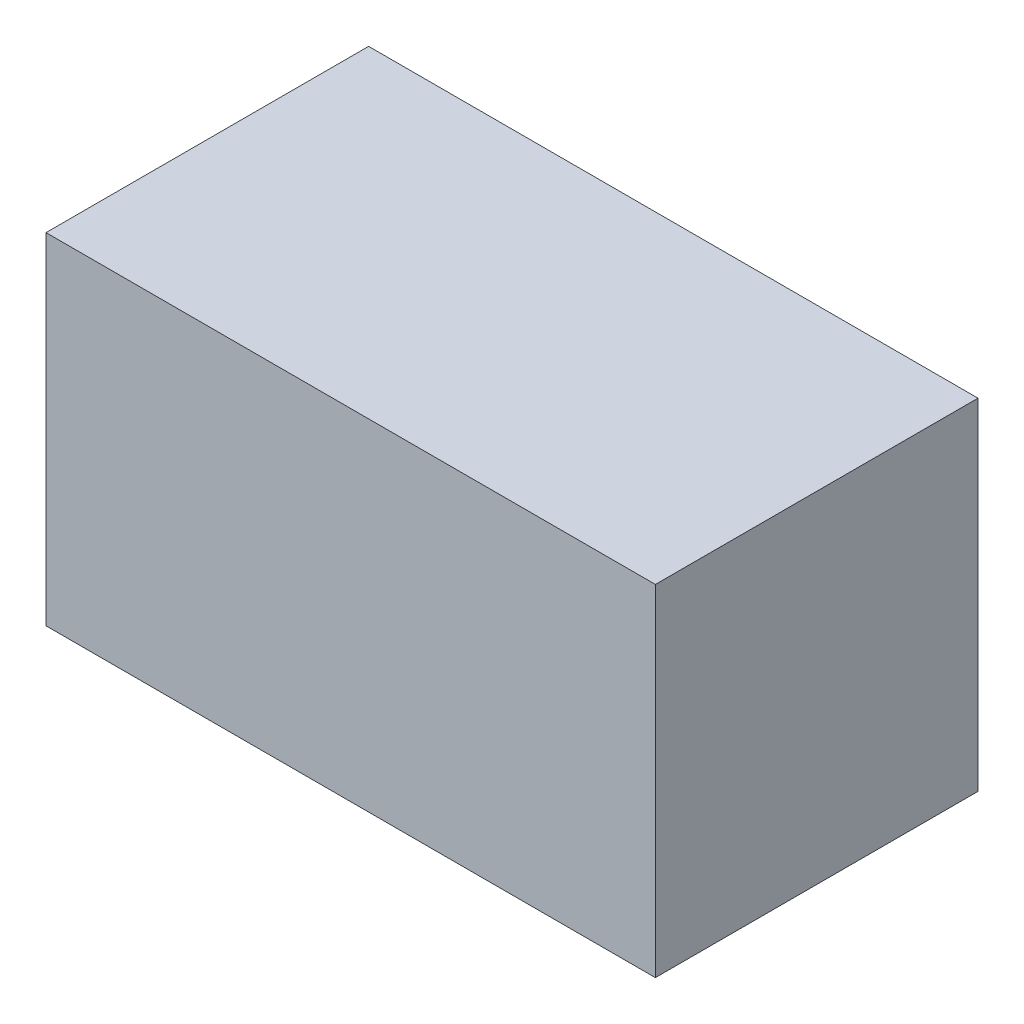
ISO-10303-21;
HEADER;
FILE_DESCRIPTION(('STEP AP214'),'2;1');
FILE_NAME('part.step','',(''),(''),'','','');
FILE_SCHEMA(('AUTOMOTIVE_DESIGN { 1 0 10303 214 1 1 1 1 }'));
ENDSEC;
DATA;
#1=APPLICATION_CONTEXT('core data for automotive mechanical design processes');
#2=APPLICATION_PROTOCOL_DEFINITION('international standard','automotive_design',2000,#1);
#3=PRODUCT_CONTEXT('',#1,'mechanical');
#4=PRODUCT('Part','Part','',(#3));
#5=PRODUCT_RELATED_PRODUCT_CATEGORY('part','',(#4));
#6=PRODUCT_DEFINITION_FORMATION('','',#4);
#7=PRODUCT_DEFINITION_CONTEXT('part definition',#1,'design');
#8=PRODUCT_DEFINITION('design','',#6,#7);
#9=PRODUCT_DEFINITION_SHAPE('','',#8);
#10=(LENGTH_UNIT() NAMED_UNIT(*) SI_UNIT(.MILLI.,.METRE.));
#11=(NAMED_UNIT(*) PLANE_ANGLE_UNIT() SI_UNIT($,.RADIAN.));
#12=(NAMED_UNIT(*) SI_UNIT($,.STERADIAN.) SOLID_ANGLE_UNIT());
#13=UNCERTAINTY_MEASURE_WITH_UNIT(LENGTH_MEASURE(1.E-05),#10,'distance_accuracy_value','');
#14=(GEOMETRIC_REPRESENTATION_CONTEXT(3) GLOBAL_UNCERTAINTY_ASSIGNED_CONTEXT((#13)) GLOBAL_UNIT_ASSIGNED_CONTEXT((#10,
#11,#12)) REPRESENTATION_CONTEXT('',''));
#15=CARTESIAN_POINT('',(0.,0.,0.));
#16=DIRECTION('',(0.,0.,1.));
#17=DIRECTION('',(1.,0.,0.));
#18=AXIS2_PLACEMENT_3D('',#15,#16,#17);
#19=CARTESIAN_POINT('',(0.85000084,0.47500032,0.90000074));
#20=DIRECTION('',(0.,0.,-1.));
#21=DIRECTION('',(-1.,0.,0.));
#22=AXIS2_PLACEMENT_3D('',#19,#20,#21);
#23=PLANE('',#22);
#24=DIRECTION('',(0.,1.,0.));
#25=VECTOR('',#24,1.);
#26=CARTESIAN_POINT('',(-0.85000084,0.47500032,0.90000074));
#27=LINE('',#26,#25);
#28=CARTESIAN_POINT('',(-0.85000084,0.47500032,0.90000074));
#29=VERTEX_POINT('',#28);
#30=CARTESIAN_POINT('',(-0.85000084,-0.47500032,0.90000074));
#31=VERTEX_POINT('',#30);
#32=EDGE_CURVE('E55',#29,#31,#27,.F.);
#33=ORIENTED_EDGE('',*,*,#32,.T.);
#34=DIRECTION('',(1.,0.,0.));
#35=VECTOR('',#34,1.);
#36=CARTESIAN_POINT('',(-0.85000084,-0.47500032,0.90000074));
#37=LINE('',#36,#35);
#38=CARTESIAN_POINT('',(0.85000084,-0.47500032,0.90000074));
#39=VERTEX_POINT('',#38);
#40=EDGE_CURVE('E57',#31,#39,#37,.T.);
#41=ORIENTED_EDGE('',*,*,#40,.T.);
#42=DIRECTION('',(0.,1.,0.));
#43=VECTOR('',#42,1.);
#44=CARTESIAN_POINT('',(0.85000084,-0.47500032,0.90000074));
#45=LINE('',#44,#43);
#46=CARTESIAN_POINT('',(0.85000084,0.47500032,0.90000074));
#47=VERTEX_POINT('',#46);
#48=EDGE_CURVE('E20',#39,#47,#45,.T.);
#49=ORIENTED_EDGE('',*,*,#48,.T.);
#50=DIRECTION('',(1.,0.,0.));
#51=VECTOR('',#50,1.);
#52=CARTESIAN_POINT('',(0.85000084,0.47500032,0.90000074));
#53=LINE('',#52,#51);
#54=EDGE_CURVE('E80',#47,#29,#53,.F.);
#55=ORIENTED_EDGE('',*,*,#54,.T.);
#56=EDGE_LOOP('',(#33,#41,#49,#55));
#57=FACE_BOUND('',#56,.T.);
#58=ADVANCED_FACE('F17',(#57),#23,.F.);
#59=CARTESIAN_POINT('',(0.85000084,-0.47500032,0.));
#60=DIRECTION('',(-1.,0.,0.));
#61=DIRECTION('',(0.,0.,1.));
#62=AXIS2_PLACEMENT_3D('',#59,#60,#61);
#63=PLANE('',#62);
#64=DIRECTION('',(0.,0.,-1.));
#65=VECTOR('',#64,1.);
#66=CARTESIAN_POINT('',(0.85000084,0.47500032,0.));
#67=LINE('',#66,#65);
#68=CARTESIAN_POINT('',(0.85000084,0.47500032,0.));
#69=VERTEX_POINT('',#68);
#70=EDGE_CURVE('E68',#69,#47,#67,.F.);
#71=ORIENTED_EDGE('',*,*,#70,.T.);
#72=ORIENTED_EDGE('',*,*,#48,.F.);
#73=DIRECTION('',(0.,0.,1.));
#74=VECTOR('',#73,1.);
#75=CARTESIAN_POINT('',(0.85000084,-0.47500032,0.));
#76=LINE('',#75,#74);
#77=CARTESIAN_POINT('',(0.85000084,-0.47500032,0.));
#78=VERTEX_POINT('',#77);
#79=EDGE_CURVE('E63',#39,#78,#76,.F.);
#80=ORIENTED_EDGE('',*,*,#79,.T.);
#81=DIRECTION('',(0.,1.,0.));
#82=VECTOR('',#81,1.);
#83=CARTESIAN_POINT('',(0.85000084,0.47500032,0.));
#84=LINE('',#83,#82);
#85=EDGE_CURVE('E83',#69,#78,#84,.F.);
#86=ORIENTED_EDGE('',*,*,#85,.F.);
#87=EDGE_LOOP('',(#71,#72,#80,#86));
#88=FACE_BOUND('',#87,.T.);
#89=ADVANCED_FACE('F65',(#88),#63,.F.);
#90=CARTESIAN_POINT('',(-0.85000084,-0.47500032,0.));
#91=DIRECTION('',(0.,1.,0.));
#92=DIRECTION('',(0.,0.,1.));
#93=AXIS2_PLACEMENT_3D('',#90,#91,#92);
#94=PLANE('',#93);
#95=ORIENTED_EDGE('',*,*,#79,.F.);
#96=ORIENTED_EDGE('',*,*,#40,.F.);
#97=DIRECTION('',(0.,0.,-1.));
#98=VECTOR('',#97,1.);
#99=CARTESIAN_POINT('',(-0.85000084,-0.47500032,0.));
#100=LINE('',#99,#98);
#101=CARTESIAN_POINT('',(-0.85000084,-0.47500032,0.));
#102=VERTEX_POINT('',#101);
#103=EDGE_CURVE('E75',#31,#102,#100,.T.);
#104=ORIENTED_EDGE('',*,*,#103,.T.);
#105=DIRECTION('',(-1.,0.,0.));
#106=VECTOR('',#105,1.);
#107=CARTESIAN_POINT('',(0.85000084,-0.47500032,0.));
#108=LINE('',#107,#106);
#109=EDGE_CURVE('E72',#78,#102,#108,.T.);
#110=ORIENTED_EDGE('',*,*,#109,.F.);
#111=EDGE_LOOP('',(#95,#96,#104,#110));
#112=FACE_BOUND('',#111,.T.);
#113=ADVANCED_FACE('F70',(#112),#94,.F.);
#114=CARTESIAN_POINT('',(-0.85000084,0.47500032,0.));
#115=DIRECTION('',(1.,0.,0.));
#116=DIRECTION('',(0.,0.,-1.));
#117=AXIS2_PLACEMENT_3D('',#114,#115,#116);
#118=PLANE('',#117);
#119=ORIENTED_EDGE('',*,*,#103,.F.);
#120=ORIENTED_EDGE('',*,*,#32,.F.);
#121=DIRECTION('',(0.,0.,-1.));
#122=VECTOR('',#121,1.);
#123=CARTESIAN_POINT('',(-0.85000084,0.47500032,0.));
#124=LINE('',#123,#122);
#125=CARTESIAN_POINT('',(-0.85000084,0.47500032,0.));
#126=VERTEX_POINT('',#125);
#127=EDGE_CURVE('E35',#29,#126,#124,.T.);
#128=ORIENTED_EDGE('',*,*,#127,.T.);
#129=DIRECTION('',(0.,1.,0.));
#130=VECTOR('',#129,1.);
#131=CARTESIAN_POINT('',(-0.85000084,0.47500032,0.));
#132=LINE('',#131,#130);
#133=EDGE_CURVE('E26',#102,#126,#132,.T.);
#134=ORIENTED_EDGE('',*,*,#133,.F.);
#135=EDGE_LOOP('',(#119,#120,#128,#134));
#136=FACE_BOUND('',#135,.T.);
#137=ADVANCED_FACE('F89',(#136),#118,.F.);
#138=CARTESIAN_POINT('',(0.85000084,0.47500032,0.));
#139=DIRECTION('',(0.,-1.,0.));
#140=DIRECTION('',(0.,0.,-1.));
#141=AXIS2_PLACEMENT_3D('',#138,#139,#140);
#142=PLANE('',#141);
#143=ORIENTED_EDGE('',*,*,#127,.F.);
#144=ORIENTED_EDGE('',*,*,#54,.F.);
#145=ORIENTED_EDGE('',*,*,#70,.F.);
#146=DIRECTION('',(-1.,0.,0.));
#147=VECTOR('',#146,1.);
#148=CARTESIAN_POINT('',(0.85000084,0.47500032,0.));
#149=LINE('',#148,#147);
#150=EDGE_CURVE('E11',#126,#69,#149,.F.);
#151=ORIENTED_EDGE('',*,*,#150,.F.);
#152=EDGE_LOOP('',(#143,#144,#145,#151));
#153=FACE_BOUND('',#152,.T.);
#154=ADVANCED_FACE('F91',(#153),#142,.F.);
#155=CARTESIAN_POINT('',(0.85000084,0.47500032,0.));
#156=DIRECTION('',(0.,0.,-1.));
#157=DIRECTION('',(-1.,0.,0.));
#158=AXIS2_PLACEMENT_3D('',#155,#156,#157);
#159=PLANE('',#158);
#160=ORIENTED_EDGE('',*,*,#133,.T.);
#161=ORIENTED_EDGE('',*,*,#150,.T.);
#162=ORIENTED_EDGE('',*,*,#85,.T.);
#163=ORIENTED_EDGE('',*,*,#109,.T.);
#164=EDGE_LOOP('',(#160,#161,#162,#163));
#165=FACE_BOUND('',#164,.T.);
#166=ADVANCED_FACE('F88',(#165),#159,.T.);
#167=CLOSED_SHELL('',(#58,#89,#113,#137,#154,#166));
#168=MANIFOLD_SOLID_BREP('B1',#167);
#169=ADVANCED_BREP_SHAPE_REPRESENTATION('',(#18,#168),#14);
#170=SHAPE_DEFINITION_REPRESENTATION(#9,#169);
ENDSEC;
END-ISO-10303-21;
